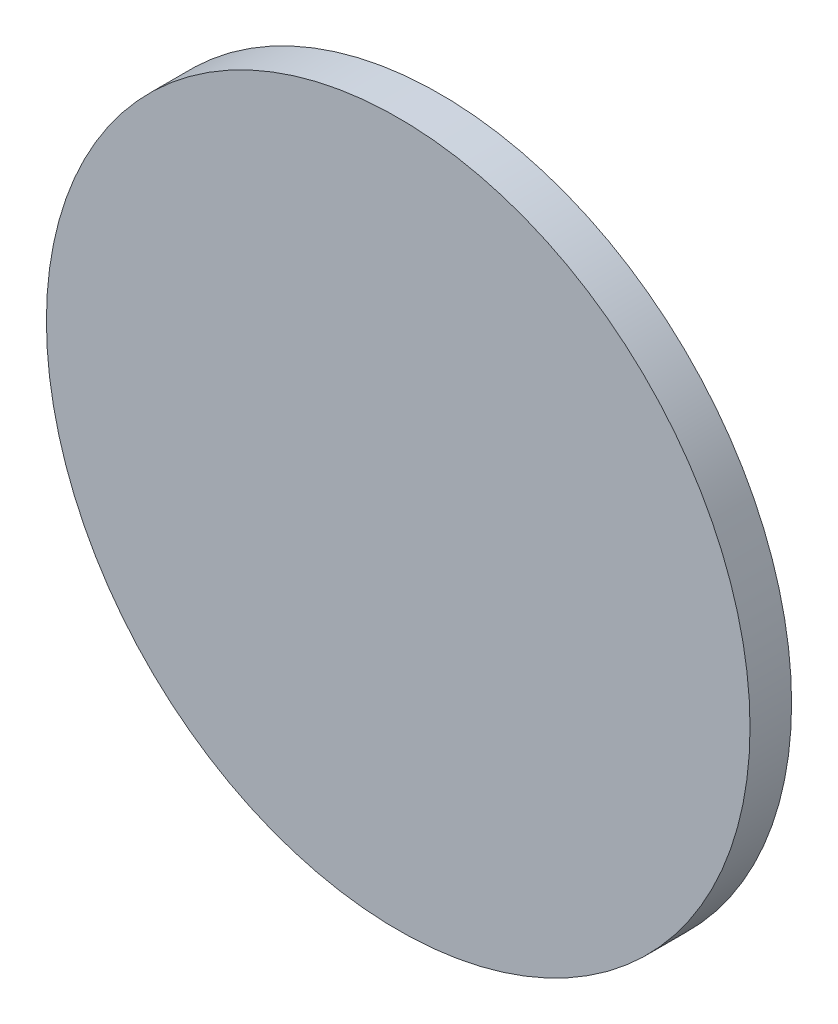
ISO-10303-21;
HEADER;
FILE_DESCRIPTION(('STEP AP214'),'2;1');
FILE_NAME('part.step','',(''),(''),'','','');
FILE_SCHEMA(('AUTOMOTIVE_DESIGN { 1 0 10303 214 1 1 1 1 }'));
ENDSEC;
DATA;
#1=APPLICATION_CONTEXT('core data for automotive mechanical design processes');
#2=APPLICATION_PROTOCOL_DEFINITION('international standard','automotive_design',2000,#1);
#3=PRODUCT_CONTEXT('',#1,'mechanical');
#4=PRODUCT('Part','Part','',(#3));
#5=PRODUCT_RELATED_PRODUCT_CATEGORY('part','',(#4));
#6=PRODUCT_DEFINITION_FORMATION('','',#4);
#7=PRODUCT_DEFINITION_CONTEXT('part definition',#1,'design');
#8=PRODUCT_DEFINITION('design','',#6,#7);
#9=PRODUCT_DEFINITION_SHAPE('','',#8);
#10=(LENGTH_UNIT() NAMED_UNIT(*) SI_UNIT(.MILLI.,.METRE.));
#11=(NAMED_UNIT(*) PLANE_ANGLE_UNIT() SI_UNIT($,.RADIAN.));
#12=(NAMED_UNIT(*) SI_UNIT($,.STERADIAN.) SOLID_ANGLE_UNIT());
#13=UNCERTAINTY_MEASURE_WITH_UNIT(LENGTH_MEASURE(1.E-05),#10,'distance_accuracy_value','');
#14=(GEOMETRIC_REPRESENTATION_CONTEXT(3) GLOBAL_UNCERTAINTY_ASSIGNED_CONTEXT((#13)) GLOBAL_UNIT_ASSIGNED_CONTEXT((#10,
#11,#12)) REPRESENTATION_CONTEXT('',''));
#15=CARTESIAN_POINT('',(0.,0.,0.));
#16=DIRECTION('',(0.,0.,1.));
#17=DIRECTION('',(1.,0.,0.));
#18=AXIS2_PLACEMENT_3D('',#15,#16,#17);
#19=CARTESIAN_POINT('',(0.,0.,3.));
#20=DIRECTION('',(0.,0.,-1.));
#21=DIRECTION('',(-1.,0.,0.));
#22=AXIS2_PLACEMENT_3D('',#19,#20,#21);
#23=CYLINDRICAL_SURFACE('',#22,25.4);
#24=CARTESIAN_POINT('',(0.,0.,3.));
#25=DIRECTION('',(0.,0.,1.));
#26=DIRECTION('',(1.,0.,0.));
#27=AXIS2_PLACEMENT_3D('',#24,#25,#26);
#28=CIRCLE('',#27,25.4);
#29=CARTESIAN_POINT('',(25.4,0.,3.));
#30=VERTEX_POINT('',#29);
#31=EDGE_CURVE('E10',#30,#30,#28,.T.);
#32=ORIENTED_EDGE('',*,*,#31,.F.);
#33=EDGE_LOOP('',(#32));
#34=FACE_BOUND('',#33,.T.);
#35=CARTESIAN_POINT('',(0.,0.,0.));
#36=DIRECTION('',(0.,0.,1.));
#37=DIRECTION('',(1.,0.,0.));
#38=AXIS2_PLACEMENT_3D('',#35,#36,#37);
#39=CIRCLE('',#38,25.4);
#40=CARTESIAN_POINT('',(25.4,0.,0.));
#41=VERTEX_POINT('',#40);
#42=EDGE_CURVE('E34',#41,#41,#39,.T.);
#43=ORIENTED_EDGE('',*,*,#42,.T.);
#44=EDGE_LOOP('',(#43));
#45=FACE_BOUND('',#44,.T.);
#46=ADVANCED_FACE('F31',(#34,#45),#23,.T.);
#47=CARTESIAN_POINT('',(0.,0.,3.));
#48=DIRECTION('',(0.,0.,1.));
#49=DIRECTION('',(1.,0.,0.));
#50=AXIS2_PLACEMENT_3D('',#47,#48,#49);
#51=PLANE('',#50);
#52=ORIENTED_EDGE('',*,*,#31,.T.);
#53=EDGE_LOOP('',(#52));
#54=FACE_BOUND('',#53,.T.);
#55=ADVANCED_FACE('F46',(#54),#51,.T.);
#56=CARTESIAN_POINT('',(0.,0.,0.));
#57=DIRECTION('',(0.,0.,1.));
#58=DIRECTION('',(1.,0.,0.));
#59=AXIS2_PLACEMENT_3D('',#56,#57,#58);
#60=PLANE('',#59);
#61=ORIENTED_EDGE('',*,*,#42,.F.);
#62=EDGE_LOOP('',(#61));
#63=FACE_BOUND('',#62,.T.);
#64=ADVANCED_FACE('F44',(#63),#60,.F.);
#65=CLOSED_SHELL('',(#46,#55,#64));
#66=MANIFOLD_SOLID_BREP('B2',#65);
#67=ADVANCED_BREP_SHAPE_REPRESENTATION('',(#18,#66),#14);
#68=SHAPE_DEFINITION_REPRESENTATION(#9,#67);
ENDSEC;
END-ISO-10303-21;
